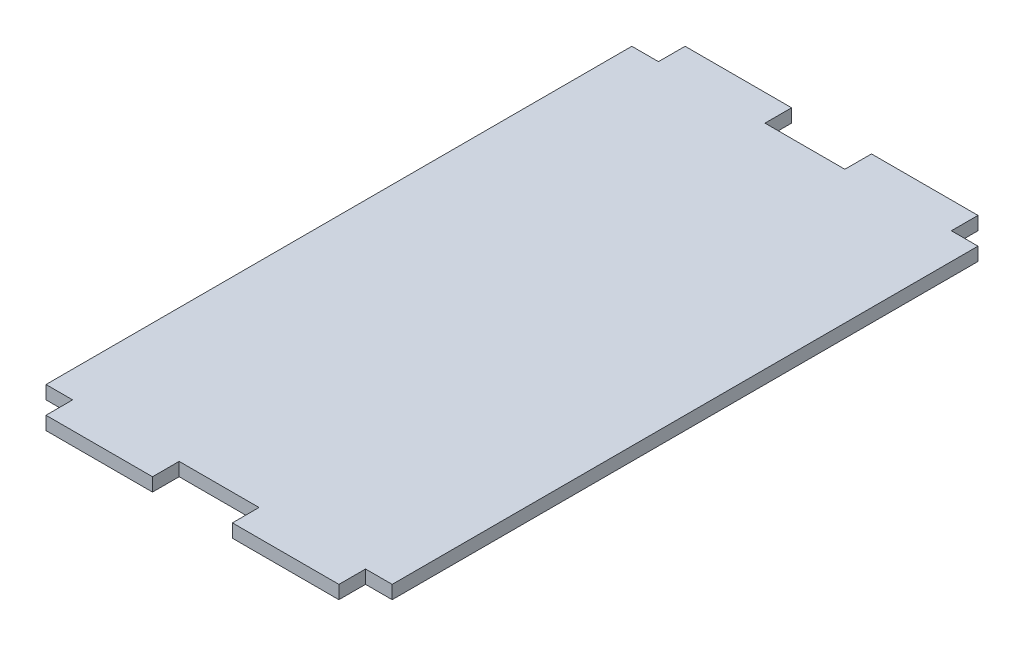
ISO-10303-21;
HEADER;
FILE_DESCRIPTION(('STEP AP214'),'2;1');
FILE_NAME('part.step','',(''),(''),'','','');
FILE_SCHEMA(('AUTOMOTIVE_DESIGN { 1 0 10303 214 1 1 1 1 }'));
ENDSEC;
DATA;
#1=APPLICATION_CONTEXT('core data for automotive mechanical design processes');
#2=APPLICATION_PROTOCOL_DEFINITION('international standard','automotive_design',2000,#1);
#3=PRODUCT_CONTEXT('',#1,'mechanical');
#4=PRODUCT('Part','Part','',(#3));
#5=PRODUCT_RELATED_PRODUCT_CATEGORY('part','',(#4));
#6=PRODUCT_DEFINITION_FORMATION('','',#4);
#7=PRODUCT_DEFINITION_CONTEXT('part definition',#1,'design');
#8=PRODUCT_DEFINITION('design','',#6,#7);
#9=PRODUCT_DEFINITION_SHAPE('','',#8);
#10=(LENGTH_UNIT() NAMED_UNIT(*) SI_UNIT(.MILLI.,.METRE.));
#11=(NAMED_UNIT(*) PLANE_ANGLE_UNIT() SI_UNIT($,.RADIAN.));
#12=(NAMED_UNIT(*) SI_UNIT($,.STERADIAN.) SOLID_ANGLE_UNIT());
#13=UNCERTAINTY_MEASURE_WITH_UNIT(LENGTH_MEASURE(1.E-05),#10,'distance_accuracy_value','');
#14=(GEOMETRIC_REPRESENTATION_CONTEXT(3) GLOBAL_UNCERTAINTY_ASSIGNED_CONTEXT((#13)) GLOBAL_UNIT_ASSIGNED_CONTEXT((#10,
#11,#12)) REPRESENTATION_CONTEXT('',''));
#15=CARTESIAN_POINT('',(0.,0.,0.));
#16=DIRECTION('',(0.,0.,1.));
#17=DIRECTION('',(1.,0.,0.));
#18=AXIS2_PLACEMENT_3D('',#15,#16,#17);
#19=CARTESIAN_POINT('',(-41.275,3.175,-76.2));
#20=DIRECTION('',(0.,0.,1.));
#21=DIRECTION('',(1.,0.,0.));
#22=AXIS2_PLACEMENT_3D('',#19,#20,#21);
#23=PLANE('',#22);
#24=DIRECTION('',(-1.,0.,0.));
#25=VECTOR('',#24,1.);
#26=CARTESIAN_POINT('',(-41.275,0.,-76.2));
#27=LINE('',#26,#25);
#28=CARTESIAN_POINT('',(-9.525,0.,-76.2));
#29=VERTEX_POINT('',#28);
#30=CARTESIAN_POINT('',(-34.925,0.,-76.2));
#31=VERTEX_POINT('',#30);
#32=EDGE_CURVE('E191',#29,#31,#27,.T.);
#33=ORIENTED_EDGE('',*,*,#32,.T.);
#34=DIRECTION('',(0.,1.,0.));
#35=VECTOR('',#34,1.);
#36=CARTESIAN_POINT('',(-34.925,0.,-76.2));
#37=LINE('',#36,#35);
#38=CARTESIAN_POINT('',(-34.925,3.175,-76.2));
#39=VERTEX_POINT('',#38);
#40=EDGE_CURVE('E174',#31,#39,#37,.T.);
#41=ORIENTED_EDGE('',*,*,#40,.T.);
#42=DIRECTION('',(-1.,0.,0.));
#43=VECTOR('',#42,1.);
#44=CARTESIAN_POINT('',(-41.275,3.175,-76.2));
#45=LINE('',#44,#43);
#46=CARTESIAN_POINT('',(-9.525,3.175,-76.2));
#47=VERTEX_POINT('',#46);
#48=EDGE_CURVE('E221',#47,#39,#45,.T.);
#49=ORIENTED_EDGE('',*,*,#48,.F.);
#50=DIRECTION('',(0.,1.,0.));
#51=VECTOR('',#50,1.);
#52=CARTESIAN_POINT('',(-9.525,0.,-76.2));
#53=LINE('',#52,#51);
#54=EDGE_CURVE('E195',#29,#47,#53,.T.);
#55=ORIENTED_EDGE('',*,*,#54,.F.);
#56=EDGE_LOOP('',(#33,#41,#49,#55));
#57=FACE_BOUND('',#56,.T.);
#58=ADVANCED_FACE('F34',(#57),#23,.F.);
#59=CARTESIAN_POINT('',(34.925,0.,-76.2));
#60=VERTEX_POINT('',#59);
#61=CARTESIAN_POINT('',(9.52500000000004,0.,-76.2));
#62=VERTEX_POINT('',#61);
#63=EDGE_CURVE('E196',#60,#62,#27,.T.);
#64=ORIENTED_EDGE('',*,*,#63,.T.);
#65=DIRECTION('',(0.,1.,0.));
#66=VECTOR('',#65,1.);
#67=CARTESIAN_POINT('',(9.52500000000004,0.,-76.2));
#68=LINE('',#67,#66);
#69=CARTESIAN_POINT('',(9.52500000000004,3.175,-76.2));
#70=VERTEX_POINT('',#69);
#71=EDGE_CURVE('E320',#62,#70,#68,.T.);
#72=ORIENTED_EDGE('',*,*,#71,.T.);
#73=CARTESIAN_POINT('',(34.925,3.175,-76.2));
#74=VERTEX_POINT('',#73);
#75=EDGE_CURVE('E227',#74,#70,#45,.T.);
#76=ORIENTED_EDGE('',*,*,#75,.F.);
#77=DIRECTION('',(0.,1.,0.));
#78=VECTOR('',#77,1.);
#79=CARTESIAN_POINT('',(34.925,0.,-76.2));
#80=LINE('',#79,#78);
#81=EDGE_CURVE('E300',#60,#74,#80,.T.);
#82=ORIENTED_EDGE('',*,*,#81,.F.);
#83=EDGE_LOOP('',(#64,#72,#76,#82));
#84=FACE_BOUND('',#83,.T.);
#85=ADVANCED_FACE('F366',(#84),#23,.F.);
#86=CARTESIAN_POINT('',(-41.275,3.175,-76.2));
#87=DIRECTION('',(1.,0.,0.));
#88=DIRECTION('',(0.,0.,-1.));
#89=AXIS2_PLACEMENT_3D('',#86,#87,#88);
#90=PLANE('',#89);
#91=DIRECTION('',(0.,1.,0.));
#92=VECTOR('',#91,1.);
#93=CARTESIAN_POINT('',(-41.275,0.,-69.85));
#94=LINE('',#93,#92);
#95=CARTESIAN_POINT('',(-41.275,0.,-69.85));
#96=VERTEX_POINT('',#95);
#97=CARTESIAN_POINT('',(-41.275,3.175,-69.85));
#98=VERTEX_POINT('',#97);
#99=EDGE_CURVE('E185',#96,#98,#94,.T.);
#100=ORIENTED_EDGE('',*,*,#99,.F.);
#101=DIRECTION('',(0.,0.,1.));
#102=VECTOR('',#101,1.);
#103=CARTESIAN_POINT('',(-41.275,0.,-76.2));
#104=LINE('',#103,#102);
#105=CARTESIAN_POINT('',(-41.275,0.,69.8499999999999));
#106=VERTEX_POINT('',#105);
#107=EDGE_CURVE('E200',#96,#106,#104,.T.);
#108=ORIENTED_EDGE('',*,*,#107,.T.);
#109=DIRECTION('',(0.,1.,0.));
#110=VECTOR('',#109,1.);
#111=CARTESIAN_POINT('',(-41.275,0.,69.85));
#112=LINE('',#111,#110);
#113=CARTESIAN_POINT('',(-41.275,3.175,69.85));
#114=VERTEX_POINT('',#113);
#115=EDGE_CURVE('E284',#106,#114,#112,.T.);
#116=ORIENTED_EDGE('',*,*,#115,.T.);
#117=DIRECTION('',(0.,0.,1.));
#118=VECTOR('',#117,1.);
#119=CARTESIAN_POINT('',(-41.275,3.175,-76.2));
#120=LINE('',#119,#118);
#121=EDGE_CURVE('E233',#98,#114,#120,.T.);
#122=ORIENTED_EDGE('',*,*,#121,.F.);
#123=EDGE_LOOP('',(#100,#108,#116,#122));
#124=FACE_BOUND('',#123,.T.);
#125=ADVANCED_FACE('F344',(#124),#90,.F.);
#126=CARTESIAN_POINT('',(41.275,3.175,-76.2));
#127=DIRECTION('',(-1.,0.,0.));
#128=DIRECTION('',(0.,0.,1.));
#129=AXIS2_PLACEMENT_3D('',#126,#127,#128);
#130=PLANE('',#129);
#131=DIRECTION('',(0.,0.,-1.));
#132=VECTOR('',#131,1.);
#133=CARTESIAN_POINT('',(41.275,0.,-76.2));
#134=LINE('',#133,#132);
#135=CARTESIAN_POINT('',(41.275,0.,69.85));
#136=VERTEX_POINT('',#135);
#137=CARTESIAN_POINT('',(41.275,0.,-69.85));
#138=VERTEX_POINT('',#137);
#139=EDGE_CURVE('E197',#136,#138,#134,.T.);
#140=ORIENTED_EDGE('',*,*,#139,.T.);
#141=DIRECTION('',(0.,1.,0.));
#142=VECTOR('',#141,1.);
#143=CARTESIAN_POINT('',(41.275,0.,-69.85));
#144=LINE('',#143,#142);
#145=CARTESIAN_POINT('',(41.275,3.175,-69.85));
#146=VERTEX_POINT('',#145);
#147=EDGE_CURVE('E297',#138,#146,#144,.T.);
#148=ORIENTED_EDGE('',*,*,#147,.T.);
#149=DIRECTION('',(0.,0.,-1.));
#150=VECTOR('',#149,1.);
#151=CARTESIAN_POINT('',(41.275,3.175,-76.2));
#152=LINE('',#151,#150);
#153=CARTESIAN_POINT('',(41.275,3.175,69.85));
#154=VERTEX_POINT('',#153);
#155=EDGE_CURVE('E215',#154,#146,#152,.T.);
#156=ORIENTED_EDGE('',*,*,#155,.F.);
#157=DIRECTION('',(0.,1.,0.));
#158=VECTOR('',#157,1.);
#159=CARTESIAN_POINT('',(41.275,0.,69.85));
#160=LINE('',#159,#158);
#161=EDGE_CURVE('E249',#136,#154,#160,.T.);
#162=ORIENTED_EDGE('',*,*,#161,.F.);
#163=EDGE_LOOP('',(#140,#148,#156,#162));
#164=FACE_BOUND('',#163,.T.);
#165=ADVANCED_FACE('F36',(#164),#130,.F.);
#166=CARTESIAN_POINT('',(-41.275,3.175,76.2));
#167=DIRECTION('',(0.,0.,-1.));
#168=DIRECTION('',(-1.,0.,0.));
#169=AXIS2_PLACEMENT_3D('',#166,#167,#168);
#170=PLANE('',#169);
#171=DIRECTION('',(0.,1.,0.));
#172=VECTOR('',#171,1.);
#173=CARTESIAN_POINT('',(-34.925,0.,76.2));
#174=LINE('',#173,#172);
#175=CARTESIAN_POINT('',(-34.925,0.,76.2));
#176=VERTEX_POINT('',#175);
#177=CARTESIAN_POINT('',(-34.925,3.175,76.2));
#178=VERTEX_POINT('',#177);
#179=EDGE_CURVE('E202',#176,#178,#174,.T.);
#180=ORIENTED_EDGE('',*,*,#179,.F.);
#181=DIRECTION('',(1.,0.,0.));
#182=VECTOR('',#181,1.);
#183=CARTESIAN_POINT('',(-41.275,0.,76.2));
#184=LINE('',#183,#182);
#185=CARTESIAN_POINT('',(-9.525,0.,76.2));
#186=VERTEX_POINT('',#185);
#187=EDGE_CURVE('E209',#176,#186,#184,.T.);
#188=ORIENTED_EDGE('',*,*,#187,.T.);
#189=DIRECTION('',(0.,1.,0.));
#190=VECTOR('',#189,1.);
#191=CARTESIAN_POINT('',(-9.525,0.,76.2));
#192=LINE('',#191,#190);
#193=CARTESIAN_POINT('',(-9.525,3.175,76.2));
#194=VERTEX_POINT('',#193);
#195=EDGE_CURVE('E266',#186,#194,#192,.T.);
#196=ORIENTED_EDGE('',*,*,#195,.T.);
#197=DIRECTION('',(1.,0.,0.));
#198=VECTOR('',#197,1.);
#199=CARTESIAN_POINT('',(-41.275,3.175,76.2));
#200=LINE('',#199,#198);
#201=EDGE_CURVE('E11',#178,#194,#200,.T.);
#202=ORIENTED_EDGE('',*,*,#201,.F.);
#203=EDGE_LOOP('',(#180,#188,#196,#202));
#204=FACE_BOUND('',#203,.T.);
#205=ADVANCED_FACE('F399',(#204),#170,.F.);
#206=DIRECTION('',(0.,1.,0.));
#207=VECTOR('',#206,1.);
#208=CARTESIAN_POINT('',(9.52500000000004,0.,76.2));
#209=LINE('',#208,#207);
#210=CARTESIAN_POINT('',(9.52500000000004,0.,76.2));
#211=VERTEX_POINT('',#210);
#212=CARTESIAN_POINT('',(9.52500000000004,3.175,76.2));
#213=VERTEX_POINT('',#212);
#214=EDGE_CURVE('E244',#211,#213,#209,.T.);
#215=ORIENTED_EDGE('',*,*,#214,.F.);
#216=CARTESIAN_POINT('',(34.925,0.,76.2));
#217=VERTEX_POINT('',#216);
#218=EDGE_CURVE('E38',#211,#217,#184,.T.);
#219=ORIENTED_EDGE('',*,*,#218,.T.);
#220=DIRECTION('',(0.,1.,0.));
#221=VECTOR('',#220,1.);
#222=CARTESIAN_POINT('',(34.925,0.,76.2));
#223=LINE('',#222,#221);
#224=CARTESIAN_POINT('',(34.925,3.175,76.2));
#225=VERTEX_POINT('',#224);
#226=EDGE_CURVE('E245',#217,#225,#223,.T.);
#227=ORIENTED_EDGE('',*,*,#226,.T.);
#228=EDGE_CURVE('E43',#213,#225,#200,.T.);
#229=ORIENTED_EDGE('',*,*,#228,.F.);
#230=EDGE_LOOP('',(#215,#219,#227,#229));
#231=FACE_BOUND('',#230,.T.);
#232=ADVANCED_FACE('F243',(#231),#170,.F.);
#233=CARTESIAN_POINT('',(0.,3.175,0.));
#234=DIRECTION('',(0.,1.,0.));
#235=DIRECTION('',(0.,0.,1.));
#236=AXIS2_PLACEMENT_3D('',#233,#234,#235);
#237=PLANE('',#236);
#238=DIRECTION('',(0.,0.,-1.));
#239=VECTOR('',#238,1.);
#240=CARTESIAN_POINT('',(-34.925,3.175,0.));
#241=LINE('',#240,#239);
#242=CARTESIAN_POINT('',(-34.925,3.175,-69.85));
#243=VERTEX_POINT('',#242);
#244=EDGE_CURVE('E180',#243,#39,#241,.T.);
#245=ORIENTED_EDGE('',*,*,#244,.F.);
#246=DIRECTION('',(-1.,0.,0.));
#247=VECTOR('',#246,1.);
#248=CARTESIAN_POINT('',(1.52655665885959E-13,3.175,-69.8499999999999));
#249=LINE('',#248,#247);
#250=EDGE_CURVE('E193',#243,#98,#249,.T.);
#251=ORIENTED_EDGE('',*,*,#250,.T.);
#252=ORIENTED_EDGE('',*,*,#121,.T.);
#253=DIRECTION('',(-1.,0.,0.));
#254=VECTOR('',#253,1.);
#255=CARTESIAN_POINT('',(1.52655665885959E-13,3.175,69.8499999999999));
#256=LINE('',#255,#254);
#257=CARTESIAN_POINT('',(-34.925,3.175,69.85));
#258=VERTEX_POINT('',#257);
#259=EDGE_CURVE('E288',#258,#114,#256,.T.);
#260=ORIENTED_EDGE('',*,*,#259,.F.);
#261=DIRECTION('',(0.,0.,1.));
#262=VECTOR('',#261,1.);
#263=CARTESIAN_POINT('',(-34.925,3.175,0.));
#264=LINE('',#263,#262);
#265=EDGE_CURVE('E268',#258,#178,#264,.T.);
#266=ORIENTED_EDGE('',*,*,#265,.T.);
#267=ORIENTED_EDGE('',*,*,#201,.T.);
#268=DIRECTION('',(0.,0.,1.));
#269=VECTOR('',#268,1.);
#270=CARTESIAN_POINT('',(-9.525,3.175,0.));
#271=LINE('',#270,#269);
#272=CARTESIAN_POINT('',(-9.525,3.175,69.85));
#273=VERTEX_POINT('',#272);
#274=EDGE_CURVE('E269',#273,#194,#271,.T.);
#275=ORIENTED_EDGE('',*,*,#274,.F.);
#276=DIRECTION('',(-1.,0.,0.));
#277=VECTOR('',#276,1.);
#278=CARTESIAN_POINT('',(0.,3.175,69.85));
#279=LINE('',#278,#277);
#280=CARTESIAN_POINT('',(9.525,3.175,69.85));
#281=VERTEX_POINT('',#280);
#282=EDGE_CURVE('E272',#281,#273,#279,.T.);
#283=ORIENTED_EDGE('',*,*,#282,.F.);
#284=DIRECTION('',(0.,0.,1.));
#285=VECTOR('',#284,1.);
#286=CARTESIAN_POINT('',(9.52499999999954,3.175,0.));
#287=LINE('',#286,#285);
#288=EDGE_CURVE('E242',#281,#213,#287,.T.);
#289=ORIENTED_EDGE('',*,*,#288,.T.);
#290=ORIENTED_EDGE('',*,*,#228,.T.);
#291=DIRECTION('',(0.,0.,1.));
#292=VECTOR('',#291,1.);
#293=CARTESIAN_POINT('',(34.9249999999995,3.175,-2.28983498828946E-13));
#294=LINE('',#293,#292);
#295=CARTESIAN_POINT('',(34.925,3.175,69.85));
#296=VERTEX_POINT('',#295);
#297=EDGE_CURVE('E239',#296,#225,#294,.T.);
#298=ORIENTED_EDGE('',*,*,#297,.F.);
#299=DIRECTION('',(1.,0.,0.));
#300=VECTOR('',#299,1.);
#301=CARTESIAN_POINT('',(-1.52655665885959E-13,3.175,69.8499999999999));
#302=LINE('',#301,#300);
#303=EDGE_CURVE('E255',#296,#154,#302,.T.);
#304=ORIENTED_EDGE('',*,*,#303,.T.);
#305=ORIENTED_EDGE('',*,*,#155,.T.);
#306=DIRECTION('',(1.,0.,0.));
#307=VECTOR('',#306,1.);
#308=CARTESIAN_POINT('',(-1.52655665885959E-13,3.175,-69.8499999999999));
#309=LINE('',#308,#307);
#310=CARTESIAN_POINT('',(34.925,3.175,-69.85));
#311=VERTEX_POINT('',#310);
#312=EDGE_CURVE('E309',#311,#146,#309,.T.);
#313=ORIENTED_EDGE('',*,*,#312,.F.);
#314=DIRECTION('',(0.,0.,-1.));
#315=VECTOR('',#314,1.);
#316=CARTESIAN_POINT('',(34.9249999999995,3.175,2.28983498828946E-13));
#317=LINE('',#316,#315);
#318=EDGE_CURVE('E305',#311,#74,#317,.T.);
#319=ORIENTED_EDGE('',*,*,#318,.T.);
#320=ORIENTED_EDGE('',*,*,#75,.T.);
#321=DIRECTION('',(0.,0.,-1.));
#322=VECTOR('',#321,1.);
#323=CARTESIAN_POINT('',(9.52499999999954,3.175,0.));
#324=LINE('',#323,#322);
#325=CARTESIAN_POINT('',(9.525,3.175,-69.85));
#326=VERTEX_POINT('',#325);
#327=EDGE_CURVE('E323',#326,#70,#324,.T.);
#328=ORIENTED_EDGE('',*,*,#327,.F.);
#329=DIRECTION('',(-1.,0.,0.));
#330=VECTOR('',#329,1.);
#331=CARTESIAN_POINT('',(0.,3.175,-69.85));
#332=LINE('',#331,#330);
#333=CARTESIAN_POINT('',(-9.525,3.175,-69.85));
#334=VERTEX_POINT('',#333);
#335=EDGE_CURVE('E325',#326,#334,#332,.T.);
#336=ORIENTED_EDGE('',*,*,#335,.T.);
#337=DIRECTION('',(0.,0.,-1.));
#338=VECTOR('',#337,1.);
#339=CARTESIAN_POINT('',(-9.525,3.175,0.));
#340=LINE('',#339,#338);
#341=EDGE_CURVE('E304',#334,#47,#340,.T.);
#342=ORIENTED_EDGE('',*,*,#341,.T.);
#343=ORIENTED_EDGE('',*,*,#48,.T.);
#344=EDGE_LOOP('',(#245,#251,#252,#260,#266,#267,#275,#283,#289,#290,#298,#304,#305,#313,#319,
#320,#328,#336,#342,#343));
#345=FACE_BOUND('',#344,.T.);
#346=ADVANCED_FACE('F238',(#345),#237,.T.);
#347=CARTESIAN_POINT('',(0.,0.,0.));
#348=DIRECTION('',(0.,1.,0.));
#349=DIRECTION('',(0.,0.,1.));
#350=AXIS2_PLACEMENT_3D('',#347,#348,#349);
#351=PLANE('',#350);
#352=DIRECTION('',(-1.,0.,0.));
#353=VECTOR('',#352,1.);
#354=CARTESIAN_POINT('',(1.52655665885959E-13,0.,-69.8499999999999));
#355=LINE('',#354,#353);
#356=CARTESIAN_POINT('',(-34.925,0.,-69.85));
#357=VERTEX_POINT('',#356);
#358=EDGE_CURVE('E186',#357,#96,#355,.T.);
#359=ORIENTED_EDGE('',*,*,#358,.F.);
#360=DIRECTION('',(0.,0.,-1.));
#361=VECTOR('',#360,1.);
#362=CARTESIAN_POINT('',(-34.925,0.,0.));
#363=LINE('',#362,#361);
#364=EDGE_CURVE('E177',#357,#31,#363,.T.);
#365=ORIENTED_EDGE('',*,*,#364,.T.);
#366=ORIENTED_EDGE('',*,*,#32,.F.);
#367=DIRECTION('',(0.,0.,-1.));
#368=VECTOR('',#367,1.);
#369=CARTESIAN_POINT('',(-9.525,0.,0.));
#370=LINE('',#369,#368);
#371=CARTESIAN_POINT('',(-9.525,0.,-69.85));
#372=VERTEX_POINT('',#371);
#373=EDGE_CURVE('E51',#372,#29,#370,.T.);
#374=ORIENTED_EDGE('',*,*,#373,.F.);
#375=DIRECTION('',(-1.,0.,0.));
#376=VECTOR('',#375,1.);
#377=CARTESIAN_POINT('',(0.,0.,-69.85));
#378=LINE('',#377,#376);
#379=CARTESIAN_POINT('',(9.525,0.,-69.85));
#380=VERTEX_POINT('',#379);
#381=EDGE_CURVE('E332',#380,#372,#378,.T.);
#382=ORIENTED_EDGE('',*,*,#381,.F.);
#383=DIRECTION('',(0.,0.,-1.));
#384=VECTOR('',#383,1.);
#385=CARTESIAN_POINT('',(9.52499999999954,0.,0.));
#386=LINE('',#385,#384);
#387=EDGE_CURVE('E316',#380,#62,#386,.T.);
#388=ORIENTED_EDGE('',*,*,#387,.T.);
#389=ORIENTED_EDGE('',*,*,#63,.F.);
#390=DIRECTION('',(0.,0.,-1.));
#391=VECTOR('',#390,1.);
#392=CARTESIAN_POINT('',(34.9249999999995,0.,2.28983498828946E-13));
#393=LINE('',#392,#391);
#394=CARTESIAN_POINT('',(34.925,0.,-69.85));
#395=VERTEX_POINT('',#394);
#396=EDGE_CURVE('E59',#395,#60,#393,.T.);
#397=ORIENTED_EDGE('',*,*,#396,.F.);
#398=DIRECTION('',(1.,0.,0.));
#399=VECTOR('',#398,1.);
#400=CARTESIAN_POINT('',(-1.52655665885959E-13,0.,-69.8499999999999));
#401=LINE('',#400,#399);
#402=EDGE_CURVE('E308',#395,#138,#401,.T.);
#403=ORIENTED_EDGE('',*,*,#402,.T.);
#404=ORIENTED_EDGE('',*,*,#139,.F.);
#405=DIRECTION('',(1.,0.,0.));
#406=VECTOR('',#405,1.);
#407=CARTESIAN_POINT('',(-1.52655665885959E-13,0.,69.8499999999999));
#408=LINE('',#407,#406);
#409=CARTESIAN_POINT('',(34.925,0.,69.85));
#410=VERTEX_POINT('',#409);
#411=EDGE_CURVE('E254',#410,#136,#408,.T.);
#412=ORIENTED_EDGE('',*,*,#411,.F.);
#413=DIRECTION('',(0.,0.,1.));
#414=VECTOR('',#413,1.);
#415=CARTESIAN_POINT('',(34.9249999999995,0.,-2.28983498828946E-13));
#416=LINE('',#415,#414);
#417=EDGE_CURVE('E251',#410,#217,#416,.T.);
#418=ORIENTED_EDGE('',*,*,#417,.T.);
#419=ORIENTED_EDGE('',*,*,#218,.F.);
#420=DIRECTION('',(0.,0.,1.));
#421=VECTOR('',#420,1.);
#422=CARTESIAN_POINT('',(9.52499999999954,0.,0.));
#423=LINE('',#422,#421);
#424=CARTESIAN_POINT('',(9.525,0.,69.85));
#425=VERTEX_POINT('',#424);
#426=EDGE_CURVE('E271',#425,#211,#423,.T.);
#427=ORIENTED_EDGE('',*,*,#426,.F.);
#428=DIRECTION('',(-1.,0.,0.));
#429=VECTOR('',#428,1.);
#430=CARTESIAN_POINT('',(0.,0.,69.85));
#431=LINE('',#430,#429);
#432=CARTESIAN_POINT('',(-9.525,0.,69.85));
#433=VERTEX_POINT('',#432);
#434=EDGE_CURVE('E278',#425,#433,#431,.T.);
#435=ORIENTED_EDGE('',*,*,#434,.T.);
#436=DIRECTION('',(0.,0.,1.));
#437=VECTOR('',#436,1.);
#438=CARTESIAN_POINT('',(-9.525,0.,0.));
#439=LINE('',#438,#437);
#440=EDGE_CURVE('E262',#433,#186,#439,.T.);
#441=ORIENTED_EDGE('',*,*,#440,.T.);
#442=ORIENTED_EDGE('',*,*,#187,.F.);
#443=DIRECTION('',(0.,0.,1.));
#444=VECTOR('',#443,1.);
#445=CARTESIAN_POINT('',(-34.925,0.,0.));
#446=LINE('',#445,#444);
#447=CARTESIAN_POINT('',(-34.925,0.,69.85));
#448=VERTEX_POINT('',#447);
#449=EDGE_CURVE('E291',#448,#176,#446,.T.);
#450=ORIENTED_EDGE('',*,*,#449,.F.);
#451=DIRECTION('',(-1.,0.,0.));
#452=VECTOR('',#451,1.);
#453=CARTESIAN_POINT('',(1.52655665885959E-13,0.,69.8499999999999));
#454=LINE('',#453,#452);
#455=EDGE_CURVE('E285',#448,#106,#454,.T.);
#456=ORIENTED_EDGE('',*,*,#455,.T.);
#457=ORIENTED_EDGE('',*,*,#107,.F.);
#458=EDGE_LOOP('',(#359,#365,#366,#374,#382,#388,#389,#397,#403,#404,#412,#418,#419,#427,#435,
#441,#442,#450,#456,#457));
#459=FACE_BOUND('',#458,.T.);
#460=ADVANCED_FACE('F190',(#459),#351,.F.);
#461=CARTESIAN_POINT('',(-1.52655665885959E-13,0.,69.8499999999999));
#462=DIRECTION('',(0.,0.,1.));
#463=DIRECTION('',(1.,0.,0.));
#464=AXIS2_PLACEMENT_3D('',#461,#462,#463);
#465=PLANE('',#464);
#466=ORIENTED_EDGE('',*,*,#303,.F.);
#467=DIRECTION('',(0.,1.,0.));
#468=VECTOR('',#467,1.);
#469=CARTESIAN_POINT('',(34.925,0.,69.85));
#470=LINE('',#469,#468);
#471=EDGE_CURVE('E230',#410,#296,#470,.T.);
#472=ORIENTED_EDGE('',*,*,#471,.F.);
#473=ORIENTED_EDGE('',*,*,#411,.T.);
#474=ORIENTED_EDGE('',*,*,#161,.T.);
#475=EDGE_LOOP('',(#466,#472,#473,#474));
#476=FACE_BOUND('',#475,.T.);
#477=ADVANCED_FACE('F377',(#476),#465,.T.);
#478=CARTESIAN_POINT('',(34.9249999999995,0.,-2.28983498828946E-13));
#479=DIRECTION('',(-1.,0.,0.));
#480=DIRECTION('',(0.,0.,1.));
#481=AXIS2_PLACEMENT_3D('',#478,#479,#480);
#482=PLANE('',#481);
#483=ORIENTED_EDGE('',*,*,#297,.T.);
#484=ORIENTED_EDGE('',*,*,#226,.F.);
#485=ORIENTED_EDGE('',*,*,#417,.F.);
#486=ORIENTED_EDGE('',*,*,#471,.T.);
#487=EDGE_LOOP('',(#483,#484,#485,#486));
#488=FACE_BOUND('',#487,.T.);
#489=ADVANCED_FACE('F379',(#488),#482,.F.);
#490=CARTESIAN_POINT('',(-9.525,0.,0.));
#491=DIRECTION('',(-1.,0.,0.));
#492=DIRECTION('',(0.,0.,1.));
#493=AXIS2_PLACEMENT_3D('',#490,#491,#492);
#494=PLANE('',#493);
#495=ORIENTED_EDGE('',*,*,#274,.T.);
#496=ORIENTED_EDGE('',*,*,#195,.F.);
#497=ORIENTED_EDGE('',*,*,#440,.F.);
#498=DIRECTION('',(0.,1.,0.));
#499=VECTOR('',#498,1.);
#500=CARTESIAN_POINT('',(-9.525,0.,69.85));
#501=LINE('',#500,#499);
#502=EDGE_CURVE('E264',#433,#273,#501,.T.);
#503=ORIENTED_EDGE('',*,*,#502,.T.);
#504=EDGE_LOOP('',(#495,#496,#497,#503));
#505=FACE_BOUND('',#504,.T.);
#506=ADVANCED_FACE('F381',(#505),#494,.F.);
#507=CARTESIAN_POINT('',(0.,0.,69.85));
#508=DIRECTION('',(0.,0.,-1.));
#509=DIRECTION('',(-1.,0.,0.));
#510=AXIS2_PLACEMENT_3D('',#507,#508,#509);
#511=PLANE('',#510);
#512=ORIENTED_EDGE('',*,*,#282,.T.);
#513=ORIENTED_EDGE('',*,*,#502,.F.);
#514=ORIENTED_EDGE('',*,*,#434,.F.);
#515=DIRECTION('',(0.,1.,0.));
#516=VECTOR('',#515,1.);
#517=CARTESIAN_POINT('',(9.525,0.,69.85));
#518=LINE('',#517,#516);
#519=EDGE_CURVE('E261',#425,#281,#518,.T.);
#520=ORIENTED_EDGE('',*,*,#519,.T.);
#521=EDGE_LOOP('',(#512,#513,#514,#520));
#522=FACE_BOUND('',#521,.T.);
#523=ADVANCED_FACE('F387',(#522),#511,.F.);
#524=CARTESIAN_POINT('',(9.52499999999954,0.,0.));
#525=DIRECTION('',(-1.,0.,0.));
#526=DIRECTION('',(0.,0.,1.));
#527=AXIS2_PLACEMENT_3D('',#524,#525,#526);
#528=PLANE('',#527);
#529=ORIENTED_EDGE('',*,*,#288,.F.);
#530=ORIENTED_EDGE('',*,*,#519,.F.);
#531=ORIENTED_EDGE('',*,*,#426,.T.);
#532=ORIENTED_EDGE('',*,*,#214,.T.);
#533=EDGE_LOOP('',(#529,#530,#531,#532));
#534=FACE_BOUND('',#533,.T.);
#535=ADVANCED_FACE('F452',(#534),#528,.T.);
#536=CARTESIAN_POINT('',(-34.925,0.,0.));
#537=DIRECTION('',(-1.,0.,0.));
#538=DIRECTION('',(0.,0.,1.));
#539=AXIS2_PLACEMENT_3D('',#536,#537,#538);
#540=PLANE('',#539);
#541=ORIENTED_EDGE('',*,*,#265,.F.);
#542=DIRECTION('',(0.,1.,0.));
#543=VECTOR('',#542,1.);
#544=CARTESIAN_POINT('',(-34.925,0.,69.85));
#545=LINE('',#544,#543);
#546=EDGE_CURVE('E282',#448,#258,#545,.T.);
#547=ORIENTED_EDGE('',*,*,#546,.F.);
#548=ORIENTED_EDGE('',*,*,#449,.T.);
#549=ORIENTED_EDGE('',*,*,#179,.T.);
#550=EDGE_LOOP('',(#541,#547,#548,#549));
#551=FACE_BOUND('',#550,.T.);
#552=ADVANCED_FACE('F442',(#551),#540,.T.);
#553=CARTESIAN_POINT('',(1.52655665885959E-13,0.,69.8499999999999));
#554=DIRECTION('',(0.,0.,-1.));
#555=DIRECTION('',(-1.,0.,0.));
#556=AXIS2_PLACEMENT_3D('',#553,#554,#555);
#557=PLANE('',#556);
#558=ORIENTED_EDGE('',*,*,#259,.T.);
#559=ORIENTED_EDGE('',*,*,#115,.F.);
#560=ORIENTED_EDGE('',*,*,#455,.F.);
#561=ORIENTED_EDGE('',*,*,#546,.T.);
#562=EDGE_LOOP('',(#558,#559,#560,#561));
#563=FACE_BOUND('',#562,.T.);
#564=ADVANCED_FACE('F348',(#563),#557,.F.);
#565=CARTESIAN_POINT('',(-34.925,0.,0.));
#566=DIRECTION('',(1.,0.,0.));
#567=DIRECTION('',(0.,0.,-1.));
#568=AXIS2_PLACEMENT_3D('',#565,#566,#567);
#569=PLANE('',#568);
#570=ORIENTED_EDGE('',*,*,#244,.T.);
#571=ORIENTED_EDGE('',*,*,#40,.F.);
#572=ORIENTED_EDGE('',*,*,#364,.F.);
#573=DIRECTION('',(0.,1.,0.));
#574=VECTOR('',#573,1.);
#575=CARTESIAN_POINT('',(-34.925,0.,-69.85));
#576=LINE('',#575,#574);
#577=EDGE_CURVE('E257',#357,#243,#576,.T.);
#578=ORIENTED_EDGE('',*,*,#577,.T.);
#579=EDGE_LOOP('',(#570,#571,#572,#578));
#580=FACE_BOUND('',#579,.T.);
#581=ADVANCED_FACE('F176',(#580),#569,.F.);
#582=CARTESIAN_POINT('',(1.52655665885959E-13,0.,-69.8499999999999));
#583=DIRECTION('',(0.,0.,-1.));
#584=DIRECTION('',(-1.,0.,0.));
#585=AXIS2_PLACEMENT_3D('',#582,#583,#584);
#586=PLANE('',#585);
#587=ORIENTED_EDGE('',*,*,#250,.F.);
#588=ORIENTED_EDGE('',*,*,#577,.F.);
#589=ORIENTED_EDGE('',*,*,#358,.T.);
#590=ORIENTED_EDGE('',*,*,#99,.T.);
#591=EDGE_LOOP('',(#587,#588,#589,#590));
#592=FACE_BOUND('',#591,.T.);
#593=ADVANCED_FACE('F342',(#592),#586,.T.);
#594=CARTESIAN_POINT('',(-1.52655665885959E-13,0.,-69.8499999999999));
#595=DIRECTION('',(0.,0.,1.));
#596=DIRECTION('',(1.,0.,0.));
#597=AXIS2_PLACEMENT_3D('',#594,#595,#596);
#598=PLANE('',#597);
#599=ORIENTED_EDGE('',*,*,#312,.T.);
#600=ORIENTED_EDGE('',*,*,#147,.F.);
#601=ORIENTED_EDGE('',*,*,#402,.F.);
#602=DIRECTION('',(0.,1.,0.));
#603=VECTOR('',#602,1.);
#604=CARTESIAN_POINT('',(34.925,0.,-69.85));
#605=LINE('',#604,#603);
#606=EDGE_CURVE('E302',#395,#311,#605,.T.);
#607=ORIENTED_EDGE('',*,*,#606,.T.);
#608=EDGE_LOOP('',(#599,#600,#601,#607));
#609=FACE_BOUND('',#608,.T.);
#610=ADVANCED_FACE('F508',(#609),#598,.F.);
#611=CARTESIAN_POINT('',(34.9249999999995,0.,2.28983498828946E-13));
#612=DIRECTION('',(1.,0.,0.));
#613=DIRECTION('',(0.,0.,-1.));
#614=AXIS2_PLACEMENT_3D('',#611,#612,#613);
#615=PLANE('',#614);
#616=ORIENTED_EDGE('',*,*,#318,.F.);
#617=ORIENTED_EDGE('',*,*,#606,.F.);
#618=ORIENTED_EDGE('',*,*,#396,.T.);
#619=ORIENTED_EDGE('',*,*,#81,.T.);
#620=EDGE_LOOP('',(#616,#617,#618,#619));
#621=FACE_BOUND('',#620,.T.);
#622=ADVANCED_FACE('F368',(#621),#615,.T.);
#623=CARTESIAN_POINT('',(9.52499999999954,0.,0.));
#624=DIRECTION('',(1.,0.,0.));
#625=DIRECTION('',(0.,0.,-1.));
#626=AXIS2_PLACEMENT_3D('',#623,#624,#625);
#627=PLANE('',#626);
#628=ORIENTED_EDGE('',*,*,#327,.T.);
#629=ORIENTED_EDGE('',*,*,#71,.F.);
#630=ORIENTED_EDGE('',*,*,#387,.F.);
#631=DIRECTION('',(0.,1.,0.));
#632=VECTOR('',#631,1.);
#633=CARTESIAN_POINT('',(9.525,0.,-69.85));
#634=LINE('',#633,#632);
#635=EDGE_CURVE('E318',#380,#326,#634,.T.);
#636=ORIENTED_EDGE('',*,*,#635,.T.);
#637=EDGE_LOOP('',(#628,#629,#630,#636));
#638=FACE_BOUND('',#637,.T.);
#639=ADVANCED_FACE('F362',(#638),#627,.F.);
#640=CARTESIAN_POINT('',(0.,0.,-69.85));
#641=DIRECTION('',(0.,0.,-1.));
#642=DIRECTION('',(-1.,0.,0.));
#643=AXIS2_PLACEMENT_3D('',#640,#641,#642);
#644=PLANE('',#643);
#645=ORIENTED_EDGE('',*,*,#335,.F.);
#646=ORIENTED_EDGE('',*,*,#635,.F.);
#647=ORIENTED_EDGE('',*,*,#381,.T.);
#648=DIRECTION('',(0.,1.,0.));
#649=VECTOR('',#648,1.);
#650=CARTESIAN_POINT('',(-9.525,0.,-69.85));
#651=LINE('',#650,#649);
#652=EDGE_CURVE('E315',#372,#334,#651,.T.);
#653=ORIENTED_EDGE('',*,*,#652,.T.);
#654=EDGE_LOOP('',(#645,#646,#647,#653));
#655=FACE_BOUND('',#654,.T.);
#656=ADVANCED_FACE('F360',(#655),#644,.T.);
#657=CARTESIAN_POINT('',(-9.525,0.,0.));
#658=DIRECTION('',(1.,0.,0.));
#659=DIRECTION('',(0.,0.,-1.));
#660=AXIS2_PLACEMENT_3D('',#657,#658,#659);
#661=PLANE('',#660);
#662=ORIENTED_EDGE('',*,*,#341,.F.);
#663=ORIENTED_EDGE('',*,*,#652,.F.);
#664=ORIENTED_EDGE('',*,*,#373,.T.);
#665=ORIENTED_EDGE('',*,*,#54,.T.);
#666=EDGE_LOOP('',(#662,#663,#664,#665));
#667=FACE_BOUND('',#666,.T.);
#668=ADVANCED_FACE('F355',(#667),#661,.T.);
#669=CLOSED_SHELL('',(#58,#85,#125,#165,#205,#232,#346,#460,#477,#489,#506,#523,#535,#552,#564,
#581,#593,#610,#622,#639,#656,#668));
#670=MANIFOLD_SOLID_BREP('B2',#669);
#671=ADVANCED_BREP_SHAPE_REPRESENTATION('',(#18,#670),#14);
#672=SHAPE_DEFINITION_REPRESENTATION(#9,#671);
ENDSEC;
END-ISO-10303-21;
